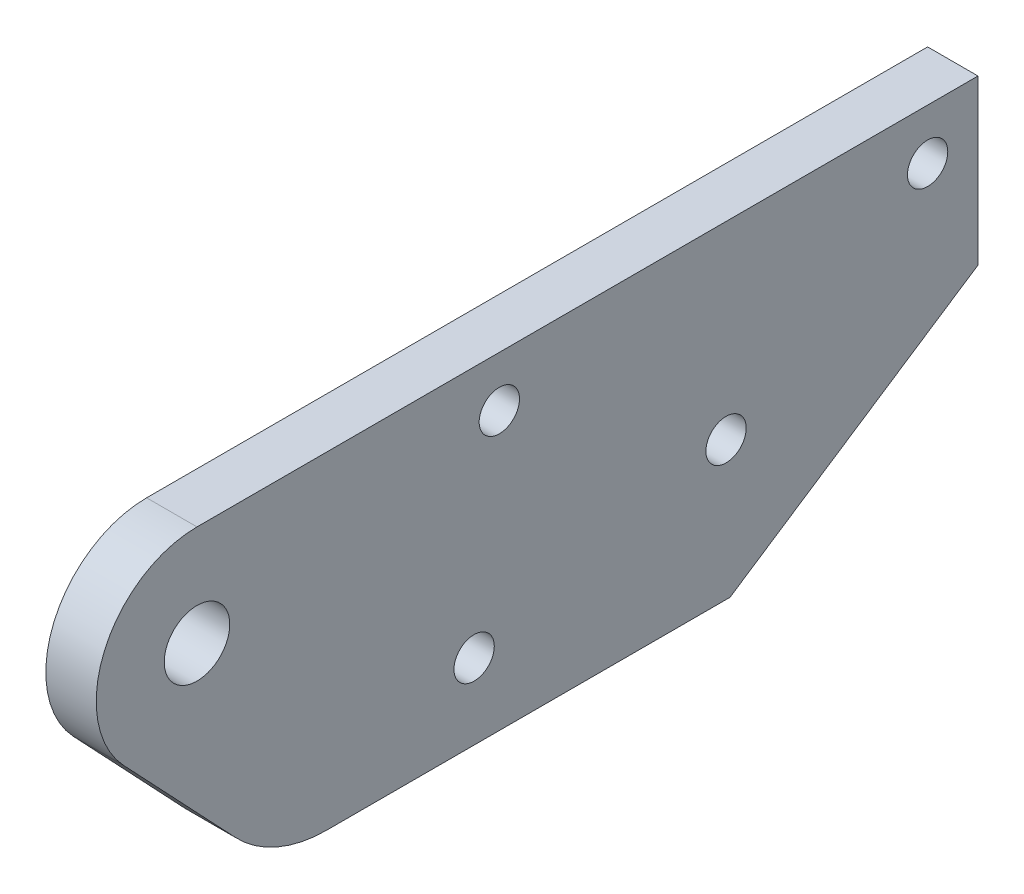
ISO-10303-21;
HEADER;
FILE_DESCRIPTION(('STEP AP214'),'2;1');
FILE_NAME('part.step','',(''),(''),'','','');
FILE_SCHEMA(('AUTOMOTIVE_DESIGN { 1 0 10303 214 1 1 1 1 }'));
ENDSEC;
DATA;
#1=APPLICATION_CONTEXT('core data for automotive mechanical design processes');
#2=APPLICATION_PROTOCOL_DEFINITION('international standard','automotive_design',2000,#1);
#3=PRODUCT_CONTEXT('',#1,'mechanical');
#4=PRODUCT('Part','Part','',(#3));
#5=PRODUCT_RELATED_PRODUCT_CATEGORY('part','',(#4));
#6=PRODUCT_DEFINITION_FORMATION('','',#4);
#7=PRODUCT_DEFINITION_CONTEXT('part definition',#1,'design');
#8=PRODUCT_DEFINITION('design','',#6,#7);
#9=PRODUCT_DEFINITION_SHAPE('','',#8);
#10=(LENGTH_UNIT() NAMED_UNIT(*) SI_UNIT(.MILLI.,.METRE.));
#11=(NAMED_UNIT(*) PLANE_ANGLE_UNIT() SI_UNIT($,.RADIAN.));
#12=(NAMED_UNIT(*) SI_UNIT($,.STERADIAN.) SOLID_ANGLE_UNIT());
#13=UNCERTAINTY_MEASURE_WITH_UNIT(LENGTH_MEASURE(1.E-05),#10,'distance_accuracy_value','');
#14=(GEOMETRIC_REPRESENTATION_CONTEXT(3) GLOBAL_UNCERTAINTY_ASSIGNED_CONTEXT((#13)) GLOBAL_UNIT_ASSIGNED_CONTEXT((#10,
#11,#12)) REPRESENTATION_CONTEXT('',''));
#15=CARTESIAN_POINT('',(0.,0.,0.));
#16=DIRECTION('',(0.,0.,1.));
#17=DIRECTION('',(1.,0.,0.));
#18=AXIS2_PLACEMENT_3D('',#15,#16,#17);
#19=CARTESIAN_POINT('',(4.,11.8788400532718,23.8951169729922));
#20=DIRECTION('',(-1.,0.,0.));
#21=DIRECTION('',(0.,0.,1.));
#22=AXIS2_PLACEMENT_3D('',#19,#20,#21);
#23=PLANE('',#22);
#24=DIRECTION('',(0.,1.,0.));
#25=VECTOR('',#24,1.);
#26=CARTESIAN_POINT('',(4.,27.8788400532719,-27.7954020523594));
#27=LINE('',#26,#25);
#28=CARTESIAN_POINT('',(4.,14.8788400532719,-27.7954020523594));
#29=VERTEX_POINT('',#28);
#30=CARTESIAN_POINT('',(4.,27.8788400532719,-27.7954020523594));
#31=VERTEX_POINT('',#30);
#32=EDGE_CURVE('E138',#29,#31,#27,.T.);
#33=ORIENTED_EDGE('',*,*,#32,.T.);
#34=DIRECTION('',(0.,0.,1.));
#35=VECTOR('',#34,1.);
#36=CARTESIAN_POINT('',(4.,27.8788400532719,-27.7954020523594));
#37=LINE('',#36,#35);
#38=CARTESIAN_POINT('',(4.,27.8788400532719,34.2045979476406));
#39=VERTEX_POINT('',#38);
#40=EDGE_CURVE('E91',#31,#39,#37,.T.);
#41=ORIENTED_EDGE('',*,*,#40,.T.);
#42=CARTESIAN_POINT('',(4.,19.8788400532719,34.2045979476404));
#43=DIRECTION('',(1.,0.,0.));
#44=DIRECTION('',(0.,0.,-1.));
#45=AXIS2_PLACEMENT_3D('',#42,#43,#44);
#46=CIRCLE('',#45,8.00000000000002);
#47=CARTESIAN_POINT('',(4.,14.3848866487272,40.0197914946079));
#48=VERTEX_POINT('',#47);
#49=EDGE_CURVE('E150',#39,#48,#46,.T.);
#50=ORIENTED_EDGE('',*,*,#49,.T.);
#51=DIRECTION('',(0.,-0.726899193370929,-0.686744175568088));
#52=VECTOR('',#51,1.);
#53=CARTESIAN_POINT('',(4.,5.01139829759091,31.1641089067015));
#54=LINE('',#53,#52);
#55=CARTESIAN_POINT('',(4.,5.01139829759091,31.1641089067015));
#56=VERTEX_POINT('',#55);
#57=EDGE_CURVE('E107',#48,#56,#54,.T.);
#58=ORIENTED_EDGE('',*,*,#57,.T.);
#59=CARTESIAN_POINT('',(4.,11.8788400532718,23.8951169729922));
#60=DIRECTION('',(1.,0.,0.));
#61=DIRECTION('',(0.,0.,1.));
#62=AXIS2_PLACEMENT_3D('',#59,#60,#61);
#63=CIRCLE('',#62,10.);
#64=CARTESIAN_POINT('',(4.,1.87884005327179,23.8951169729922));
#65=VERTEX_POINT('',#64);
#66=EDGE_CURVE('E101',#56,#65,#63,.T.);
#67=ORIENTED_EDGE('',*,*,#66,.T.);
#68=DIRECTION('',(0.,0.,-1.));
#69=VECTOR('',#68,1.);
#70=CARTESIAN_POINT('',(4.,1.8788400532718,-8.10488302700779));
#71=LINE('',#70,#69);
#72=CARTESIAN_POINT('',(4.,1.8788400532718,-8.10488302700779));
#73=VERTEX_POINT('',#72);
#74=EDGE_CURVE('E105',#65,#73,#71,.T.);
#75=ORIENTED_EDGE('',*,*,#74,.T.);
#76=DIRECTION('',(0.,0.550967891398954,-0.834526442149912));
#77=VECTOR('',#76,1.);
#78=CARTESIAN_POINT('',(4.,1.8788400532718,-8.10488302700779));
#79=LINE('',#78,#77);
#80=EDGE_CURVE('E51',#73,#29,#79,.T.);
#81=ORIENTED_EDGE('',*,*,#80,.T.);
#82=EDGE_LOOP('',(#33,#41,#50,#58,#67,#75,#81));
#83=FACE_BOUND('',#82,.T.);
#84=CARTESIAN_POINT('',(4.,23.8788400532719,-23.7954020523594));
#85=DIRECTION('',(1.,0.,0.));
#86=DIRECTION('',(0.,0.,-1.));
#87=AXIS2_PLACEMENT_3D('',#84,#85,#86);
#88=CIRCLE('',#87,1.6);
#89=CARTESIAN_POINT('',(4.,23.8788400532719,-25.3954020523594));
#90=VERTEX_POINT('',#89);
#91=EDGE_CURVE('E129',#90,#90,#88,.T.);
#92=ORIENTED_EDGE('',*,*,#91,.F.);
#93=EDGE_LOOP('',(#92));
#94=FACE_BOUND('',#93,.T.);
#95=CARTESIAN_POINT('',(4.,23.8788400532719,10.2045979476407));
#96=DIRECTION('',(1.,0.,0.));
#97=DIRECTION('',(0.,0.,-1.));
#98=AXIS2_PLACEMENT_3D('',#95,#96,#97);
#99=CIRCLE('',#98,1.6);
#100=CARTESIAN_POINT('',(4.,23.8788400532719,8.60459794764069));
#101=VERTEX_POINT('',#100);
#102=EDGE_CURVE('E165',#101,#101,#99,.T.);
#103=ORIENTED_EDGE('',*,*,#102,.F.);
#104=EDGE_LOOP('',(#103));
#105=FACE_BOUND('',#104,.T.);
#106=CARTESIAN_POINT('',(4.,12.8788400532718,-7.79540205235956));
#107=DIRECTION('',(1.,0.,0.));
#108=DIRECTION('',(0.,0.,-1.));
#109=AXIS2_PLACEMENT_3D('',#106,#107,#108);
#110=CIRCLE('',#109,1.6);
#111=CARTESIAN_POINT('',(4.,12.8788400532718,-9.39540205235956));
#112=VERTEX_POINT('',#111);
#113=EDGE_CURVE('E171',#112,#112,#110,.T.);
#114=ORIENTED_EDGE('',*,*,#113,.F.);
#115=EDGE_LOOP('',(#114));
#116=FACE_BOUND('',#115,.T.);
#117=CARTESIAN_POINT('',(4.,7.87884005327179,12.2045979476404));
#118=DIRECTION('',(1.,0.,0.));
#119=DIRECTION('',(0.,0.,-1.));
#120=AXIS2_PLACEMENT_3D('',#117,#118,#119);
#121=CIRCLE('',#120,1.6);
#122=CARTESIAN_POINT('',(4.,7.87884005327179,10.6045979476404));
#123=VERTEX_POINT('',#122);
#124=EDGE_CURVE('E177',#123,#123,#121,.T.);
#125=ORIENTED_EDGE('',*,*,#124,.F.);
#126=EDGE_LOOP('',(#125));
#127=FACE_BOUND('',#126,.T.);
#128=CARTESIAN_POINT('',(4.,19.8788400532719,34.2045979476404));
#129=DIRECTION('',(1.,0.,0.));
#130=DIRECTION('',(0.,0.,-1.));
#131=AXIS2_PLACEMENT_3D('',#128,#129,#130);
#132=CIRCLE('',#131,2.6);
#133=CARTESIAN_POINT('',(4.,19.8788400532719,31.6045979476404));
#134=VERTEX_POINT('',#133);
#135=EDGE_CURVE('E183',#134,#134,#132,.T.);
#136=ORIENTED_EDGE('',*,*,#135,.F.);
#137=EDGE_LOOP('',(#136));
#138=FACE_BOUND('',#137,.T.);
#139=ADVANCED_FACE('F34',(#83,#94,#105,#116,#127,#138),#23,.F.);
#140=CARTESIAN_POINT('',(0.,11.8788400532718,23.8951169729922));
#141=DIRECTION('',(-1.,0.,0.));
#142=DIRECTION('',(0.,0.,1.));
#143=AXIS2_PLACEMENT_3D('',#140,#141,#142);
#144=PLANE('',#143);
#145=CARTESIAN_POINT('',(0.,7.87884005327179,12.2045979476404));
#146=DIRECTION('',(1.,0.,0.));
#147=DIRECTION('',(0.,0.,-1.));
#148=AXIS2_PLACEMENT_3D('',#145,#146,#147);
#149=CIRCLE('',#148,1.6);
#150=CARTESIAN_POINT('',(0.,7.87884005327179,10.6045979476404));
#151=VERTEX_POINT('',#150);
#152=EDGE_CURVE('E180',#151,#151,#149,.T.);
#153=ORIENTED_EDGE('',*,*,#152,.T.);
#154=EDGE_LOOP('',(#153));
#155=FACE_BOUND('',#154,.T.);
#156=CARTESIAN_POINT('',(0.,23.8788400532719,10.2045979476407));
#157=DIRECTION('',(1.,0.,0.));
#158=DIRECTION('',(0.,0.,-1.));
#159=AXIS2_PLACEMENT_3D('',#156,#157,#158);
#160=CIRCLE('',#159,1.6);
#161=CARTESIAN_POINT('',(0.,23.8788400532719,8.60459794764069));
#162=VERTEX_POINT('',#161);
#163=EDGE_CURVE('E168',#162,#162,#160,.T.);
#164=ORIENTED_EDGE('',*,*,#163,.T.);
#165=EDGE_LOOP('',(#164));
#166=FACE_BOUND('',#165,.T.);
#167=DIRECTION('',(0.,1.,0.));
#168=VECTOR('',#167,1.);
#169=CARTESIAN_POINT('',(0.,27.8788400532719,-27.7954020523594));
#170=LINE('',#169,#168);
#171=CARTESIAN_POINT('',(0.,14.8788400532719,-27.7954020523594));
#172=VERTEX_POINT('',#171);
#173=CARTESIAN_POINT('',(0.,27.8788400532719,-27.7954020523594));
#174=VERTEX_POINT('',#173);
#175=EDGE_CURVE('E125',#172,#174,#170,.T.);
#176=ORIENTED_EDGE('',*,*,#175,.F.);
#177=DIRECTION('',(0.,0.550967891398954,-0.834526442149912));
#178=VECTOR('',#177,1.);
#179=CARTESIAN_POINT('',(0.,1.8788400532718,-8.10488302700779));
#180=LINE('',#179,#178);
#181=CARTESIAN_POINT('',(0.,1.8788400532718,-8.10488302700779));
#182=VERTEX_POINT('',#181);
#183=EDGE_CURVE('E83',#182,#172,#180,.T.);
#184=ORIENTED_EDGE('',*,*,#183,.F.);
#185=DIRECTION('',(0.,0.,-1.));
#186=VECTOR('',#185,1.);
#187=CARTESIAN_POINT('',(0.,1.8788400532718,-8.10488302700779));
#188=LINE('',#187,#186);
#189=CARTESIAN_POINT('',(0.,1.87884005327179,23.8951169729922));
#190=VERTEX_POINT('',#189);
#191=EDGE_CURVE('E77',#190,#182,#188,.T.);
#192=ORIENTED_EDGE('',*,*,#191,.F.);
#193=CARTESIAN_POINT('',(0.,11.8788400532718,23.8951169729922));
#194=DIRECTION('',(1.,0.,0.));
#195=DIRECTION('',(0.,0.,1.));
#196=AXIS2_PLACEMENT_3D('',#193,#194,#195);
#197=CIRCLE('',#196,10.);
#198=CARTESIAN_POINT('',(0.,5.01139829759091,31.1641089067015));
#199=VERTEX_POINT('',#198);
#200=EDGE_CURVE('E115',#199,#190,#197,.T.);
#201=ORIENTED_EDGE('',*,*,#200,.F.);
#202=DIRECTION('',(0.,-0.726899193370929,-0.686744175568088));
#203=VECTOR('',#202,1.);
#204=CARTESIAN_POINT('',(0.,5.01139829759091,31.1641089067015));
#205=LINE('',#204,#203);
#206=CARTESIAN_POINT('',(0.,14.3848866487272,40.0197914946079));
#207=VERTEX_POINT('',#206);
#208=EDGE_CURVE('E133',#207,#199,#205,.T.);
#209=ORIENTED_EDGE('',*,*,#208,.F.);
#210=CARTESIAN_POINT('',(0.,19.8788400532719,34.2045979476404));
#211=DIRECTION('',(1.,0.,0.));
#212=DIRECTION('',(0.,0.,-1.));
#213=AXIS2_PLACEMENT_3D('',#210,#211,#212);
#214=CIRCLE('',#213,8.00000000000002);
#215=CARTESIAN_POINT('',(0.,27.8788400532719,34.2045979476406));
#216=VERTEX_POINT('',#215);
#217=EDGE_CURVE('E131',#216,#207,#214,.T.);
#218=ORIENTED_EDGE('',*,*,#217,.F.);
#219=DIRECTION('',(0.,0.,1.));
#220=VECTOR('',#219,1.);
#221=CARTESIAN_POINT('',(0.,27.8788400532719,-27.7954020523594));
#222=LINE('',#221,#220);
#223=EDGE_CURVE('E128',#174,#216,#222,.T.);
#224=ORIENTED_EDGE('',*,*,#223,.F.);
#225=EDGE_LOOP('',(#176,#184,#192,#201,#209,#218,#224));
#226=FACE_BOUND('',#225,.T.);
#227=CARTESIAN_POINT('',(0.,23.8788400532719,-23.7954020523594));
#228=DIRECTION('',(1.,0.,0.));
#229=DIRECTION('',(0.,0.,-1.));
#230=AXIS2_PLACEMENT_3D('',#227,#228,#229);
#231=CIRCLE('',#230,1.6);
#232=CARTESIAN_POINT('',(0.,23.8788400532719,-25.3954020523594));
#233=VERTEX_POINT('',#232);
#234=EDGE_CURVE('E162',#233,#233,#231,.T.);
#235=ORIENTED_EDGE('',*,*,#234,.T.);
#236=EDGE_LOOP('',(#235));
#237=FACE_BOUND('',#236,.T.);
#238=CARTESIAN_POINT('',(0.,12.8788400532718,-7.79540205235956));
#239=DIRECTION('',(1.,0.,0.));
#240=DIRECTION('',(0.,0.,-1.));
#241=AXIS2_PLACEMENT_3D('',#238,#239,#240);
#242=CIRCLE('',#241,1.6);
#243=CARTESIAN_POINT('',(0.,12.8788400532718,-9.39540205235956));
#244=VERTEX_POINT('',#243);
#245=EDGE_CURVE('E174',#244,#244,#242,.T.);
#246=ORIENTED_EDGE('',*,*,#245,.T.);
#247=EDGE_LOOP('',(#246));
#248=FACE_BOUND('',#247,.T.);
#249=CARTESIAN_POINT('',(0.,19.8788400532719,34.2045979476404));
#250=DIRECTION('',(1.,0.,0.));
#251=DIRECTION('',(0.,0.,-1.));
#252=AXIS2_PLACEMENT_3D('',#249,#250,#251);
#253=CIRCLE('',#252,2.6);
#254=CARTESIAN_POINT('',(0.,19.8788400532719,31.6045979476404));
#255=VERTEX_POINT('',#254);
#256=EDGE_CURVE('E186',#255,#255,#253,.T.);
#257=ORIENTED_EDGE('',*,*,#256,.T.);
#258=EDGE_LOOP('',(#257));
#259=FACE_BOUND('',#258,.T.);
#260=ADVANCED_FACE('F154',(#155,#166,#226,#237,#248,#259),#144,.T.);
#261=CARTESIAN_POINT('',(4.,27.8788400532719,-27.7954020523594));
#262=DIRECTION('',(0.,0.,1.));
#263=DIRECTION('',(0.,-1.,0.));
#264=AXIS2_PLACEMENT_3D('',#261,#262,#263);
#265=PLANE('',#264);
#266=ORIENTED_EDGE('',*,*,#175,.T.);
#267=DIRECTION('',(-1.,0.,0.));
#268=VECTOR('',#267,1.);
#269=CARTESIAN_POINT('',(4.,27.8788400532719,-27.7954020523594));
#270=LINE('',#269,#268);
#271=EDGE_CURVE('E11',#31,#174,#270,.T.);
#272=ORIENTED_EDGE('',*,*,#271,.F.);
#273=ORIENTED_EDGE('',*,*,#32,.F.);
#274=DIRECTION('',(-1.,0.,0.));
#275=VECTOR('',#274,1.);
#276=CARTESIAN_POINT('',(4.,14.8788400532719,-27.7954020523594));
#277=LINE('',#276,#275);
#278=EDGE_CURVE('E121',#29,#172,#277,.T.);
#279=ORIENTED_EDGE('',*,*,#278,.T.);
#280=EDGE_LOOP('',(#266,#272,#273,#279));
#281=FACE_BOUND('',#280,.T.);
#282=ADVANCED_FACE('F36',(#281),#265,.F.);
#283=CARTESIAN_POINT('',(4.,27.8788400532719,-27.7954020523594));
#284=DIRECTION('',(0.,-1.,0.));
#285=DIRECTION('',(0.,0.,-1.));
#286=AXIS2_PLACEMENT_3D('',#283,#284,#285);
#287=PLANE('',#286);
#288=ORIENTED_EDGE('',*,*,#223,.T.);
#289=DIRECTION('',(-1.,0.,0.));
#290=VECTOR('',#289,1.);
#291=CARTESIAN_POINT('',(4.,27.8788400532719,34.2045979476406));
#292=LINE('',#291,#290);
#293=EDGE_CURVE('E43',#39,#216,#292,.T.);
#294=ORIENTED_EDGE('',*,*,#293,.F.);
#295=ORIENTED_EDGE('',*,*,#40,.F.);
#296=ORIENTED_EDGE('',*,*,#271,.T.);
#297=EDGE_LOOP('',(#288,#294,#295,#296));
#298=FACE_BOUND('',#297,.T.);
#299=ADVANCED_FACE('F216',(#298),#287,.F.);
#300=CARTESIAN_POINT('',(4.,19.8788400532719,34.2045979476404));
#301=DIRECTION('',(-1.,0.,0.));
#302=DIRECTION('',(0.,0.,1.));
#303=AXIS2_PLACEMENT_3D('',#300,#301,#302);
#304=CYLINDRICAL_SURFACE('',#303,8.00000000000002);
#305=ORIENTED_EDGE('',*,*,#217,.T.);
#306=DIRECTION('',(-1.,0.,0.));
#307=VECTOR('',#306,1.);
#308=CARTESIAN_POINT('',(4.,14.3848866487272,40.0197914946079));
#309=LINE('',#308,#307);
#310=EDGE_CURVE('E142',#48,#207,#309,.T.);
#311=ORIENTED_EDGE('',*,*,#310,.F.);
#312=ORIENTED_EDGE('',*,*,#49,.F.);
#313=ORIENTED_EDGE('',*,*,#293,.T.);
#314=EDGE_LOOP('',(#305,#311,#312,#313));
#315=FACE_BOUND('',#314,.T.);
#316=ADVANCED_FACE('F148',(#315),#304,.T.);
#317=CARTESIAN_POINT('',(4.,5.01139829759091,31.1641089067015));
#318=DIRECTION('',(0.,0.686744175568088,-0.726899193370929));
#319=DIRECTION('',(0.,0.726899193370929,0.686744175568088));
#320=AXIS2_PLACEMENT_3D('',#317,#318,#319);
#321=PLANE('',#320);
#322=ORIENTED_EDGE('',*,*,#208,.T.);
#323=DIRECTION('',(-1.,0.,0.));
#324=VECTOR('',#323,1.);
#325=CARTESIAN_POINT('',(4.,5.01139829759091,31.1641089067015));
#326=LINE('',#325,#324);
#327=EDGE_CURVE('E116',#56,#199,#326,.T.);
#328=ORIENTED_EDGE('',*,*,#327,.F.);
#329=ORIENTED_EDGE('',*,*,#57,.F.);
#330=ORIENTED_EDGE('',*,*,#310,.T.);
#331=EDGE_LOOP('',(#322,#328,#329,#330));
#332=FACE_BOUND('',#331,.T.);
#333=ADVANCED_FACE('F157',(#332),#321,.F.);
#334=CARTESIAN_POINT('',(4.,11.8788400532718,23.8951169729922));
#335=DIRECTION('',(-1.,0.,0.));
#336=DIRECTION('',(0.,0.,1.));
#337=AXIS2_PLACEMENT_3D('',#334,#335,#336);
#338=CYLINDRICAL_SURFACE('',#337,10.);
#339=ORIENTED_EDGE('',*,*,#200,.T.);
#340=DIRECTION('',(-1.,0.,0.));
#341=VECTOR('',#340,1.);
#342=CARTESIAN_POINT('',(4.,1.87884005327179,23.8951169729922));
#343=LINE('',#342,#341);
#344=EDGE_CURVE('E112',#65,#190,#343,.T.);
#345=ORIENTED_EDGE('',*,*,#344,.F.);
#346=ORIENTED_EDGE('',*,*,#66,.F.);
#347=ORIENTED_EDGE('',*,*,#327,.T.);
#348=EDGE_LOOP('',(#339,#345,#346,#347));
#349=FACE_BOUND('',#348,.T.);
#350=ADVANCED_FACE('F113',(#349),#338,.T.);
#351=CARTESIAN_POINT('',(4.,1.8788400532718,-8.10488302700779));
#352=DIRECTION('',(0.,1.,0.));
#353=DIRECTION('',(0.,0.,1.));
#354=AXIS2_PLACEMENT_3D('',#351,#352,#353);
#355=PLANE('',#354);
#356=ORIENTED_EDGE('',*,*,#191,.T.);
#357=DIRECTION('',(-1.,0.,0.));
#358=VECTOR('',#357,1.);
#359=CARTESIAN_POINT('',(4.,1.8788400532718,-8.10488302700779));
#360=LINE('',#359,#358);
#361=EDGE_CURVE('E117',#73,#182,#360,.T.);
#362=ORIENTED_EDGE('',*,*,#361,.F.);
#363=ORIENTED_EDGE('',*,*,#74,.F.);
#364=ORIENTED_EDGE('',*,*,#344,.T.);
#365=EDGE_LOOP('',(#356,#362,#363,#364));
#366=FACE_BOUND('',#365,.T.);
#367=ADVANCED_FACE('F119',(#366),#355,.F.);
#368=CARTESIAN_POINT('',(4.,1.8788400532718,-8.10488302700779));
#369=DIRECTION('',(0.,0.834526442149912,0.550967891398954));
#370=DIRECTION('',(0.,-0.550967891398954,0.834526442149912));
#371=AXIS2_PLACEMENT_3D('',#368,#369,#370);
#372=PLANE('',#371);
#373=ORIENTED_EDGE('',*,*,#183,.T.);
#374=ORIENTED_EDGE('',*,*,#278,.F.);
#375=ORIENTED_EDGE('',*,*,#80,.F.);
#376=ORIENTED_EDGE('',*,*,#361,.T.);
#377=EDGE_LOOP('',(#373,#374,#375,#376));
#378=FACE_BOUND('',#377,.T.);
#379=ADVANCED_FACE('F206',(#378),#372,.F.);
#380=CARTESIAN_POINT('',(4.,23.8788400532719,-23.7954020523594));
#381=DIRECTION('',(-1.,0.,0.));
#382=DIRECTION('',(0.,0.,1.));
#383=AXIS2_PLACEMENT_3D('',#380,#381,#382);
#384=CYLINDRICAL_SURFACE('',#383,1.6);
#385=ORIENTED_EDGE('',*,*,#91,.T.);
#386=EDGE_LOOP('',(#385));
#387=FACE_BOUND('',#386,.T.);
#388=ORIENTED_EDGE('',*,*,#234,.F.);
#389=EDGE_LOOP('',(#388));
#390=FACE_BOUND('',#389,.T.);
#391=ADVANCED_FACE('F203',(#387,#390),#384,.F.);
#392=CARTESIAN_POINT('',(4.,23.8788400532719,10.2045979476407));
#393=DIRECTION('',(-1.,0.,0.));
#394=DIRECTION('',(0.,0.,1.));
#395=AXIS2_PLACEMENT_3D('',#392,#393,#394);
#396=CYLINDRICAL_SURFACE('',#395,1.6);
#397=ORIENTED_EDGE('',*,*,#102,.T.);
#398=EDGE_LOOP('',(#397));
#399=FACE_BOUND('',#398,.T.);
#400=ORIENTED_EDGE('',*,*,#163,.F.);
#401=EDGE_LOOP('',(#400));
#402=FACE_BOUND('',#401,.T.);
#403=ADVANCED_FACE('F275',(#399,#402),#396,.F.);
#404=CARTESIAN_POINT('',(4.,12.8788400532718,-7.79540205235956));
#405=DIRECTION('',(-1.,0.,0.));
#406=DIRECTION('',(0.,0.,1.));
#407=AXIS2_PLACEMENT_3D('',#404,#405,#406);
#408=CYLINDRICAL_SURFACE('',#407,1.6);
#409=ORIENTED_EDGE('',*,*,#113,.T.);
#410=EDGE_LOOP('',(#409));
#411=FACE_BOUND('',#410,.T.);
#412=ORIENTED_EDGE('',*,*,#245,.F.);
#413=EDGE_LOOP('',(#412));
#414=FACE_BOUND('',#413,.T.);
#415=ADVANCED_FACE('F283',(#411,#414),#408,.F.);
#416=CARTESIAN_POINT('',(4.,7.87884005327179,12.2045979476404));
#417=DIRECTION('',(-1.,0.,0.));
#418=DIRECTION('',(0.,0.,1.));
#419=AXIS2_PLACEMENT_3D('',#416,#417,#418);
#420=CYLINDRICAL_SURFACE('',#419,1.6);
#421=ORIENTED_EDGE('',*,*,#124,.T.);
#422=EDGE_LOOP('',(#421));
#423=FACE_BOUND('',#422,.T.);
#424=ORIENTED_EDGE('',*,*,#152,.F.);
#425=EDGE_LOOP('',(#424));
#426=FACE_BOUND('',#425,.T.);
#427=ADVANCED_FACE('F291',(#423,#426),#420,.F.);
#428=CARTESIAN_POINT('',(4.,19.8788400532719,34.2045979476404));
#429=DIRECTION('',(-1.,0.,0.));
#430=DIRECTION('',(0.,0.,1.));
#431=AXIS2_PLACEMENT_3D('',#428,#429,#430);
#432=CYLINDRICAL_SURFACE('',#431,2.6);
#433=ORIENTED_EDGE('',*,*,#135,.T.);
#434=EDGE_LOOP('',(#433));
#435=FACE_BOUND('',#434,.T.);
#436=ORIENTED_EDGE('',*,*,#256,.F.);
#437=EDGE_LOOP('',(#436));
#438=FACE_BOUND('',#437,.T.);
#439=ADVANCED_FACE('F192',(#435,#438),#432,.F.);
#440=CLOSED_SHELL('',(#139,#260,#282,#299,#316,#333,#350,#367,#379,#391,#403,#415,#427,#439));
#441=MANIFOLD_SOLID_BREP('B2',#440);
#442=ADVANCED_BREP_SHAPE_REPRESENTATION('',(#18,#441),#14);
#443=SHAPE_DEFINITION_REPRESENTATION(#9,#442);
ENDSEC;
END-ISO-10303-21;
